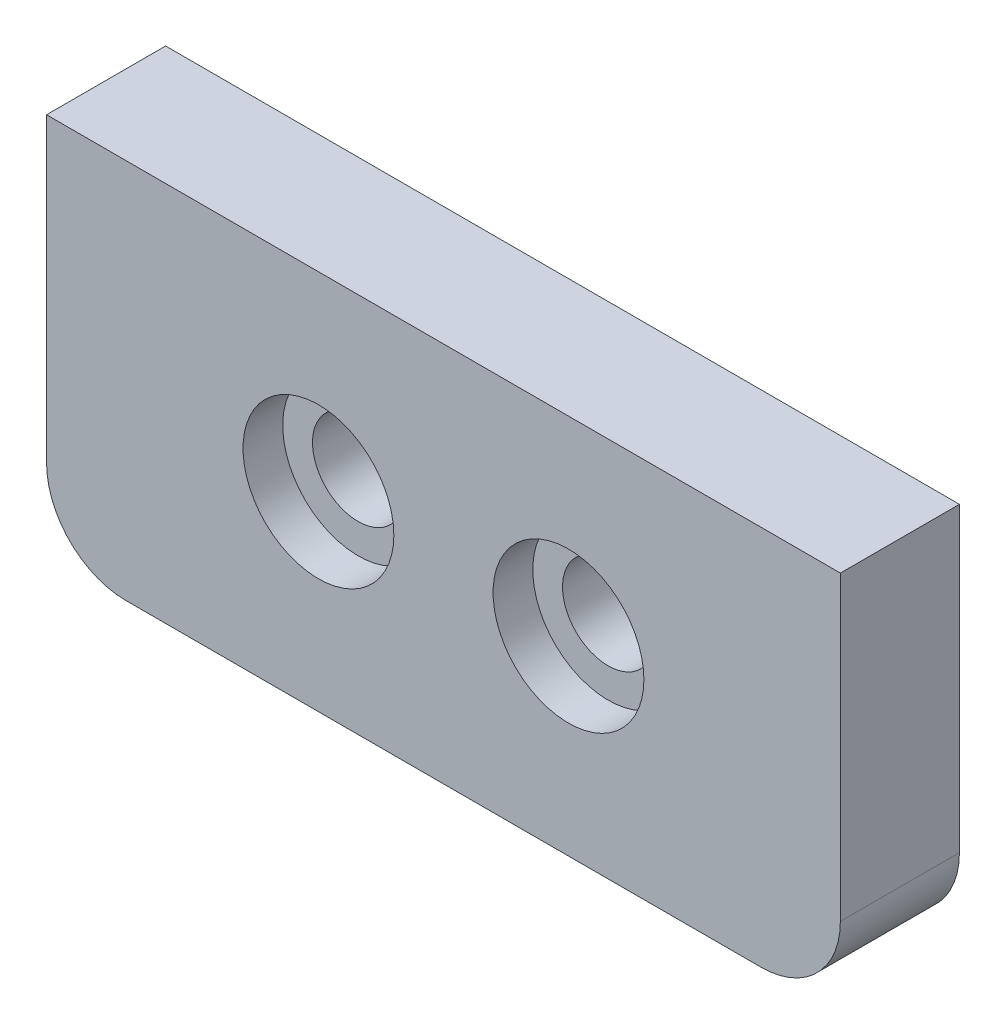
ISO-10303-21;
HEADER;
FILE_DESCRIPTION(('STEP AP214'),'2;1');
FILE_NAME('part.step','',(''),(''),'','','');
FILE_SCHEMA(('AUTOMOTIVE_DESIGN { 1 0 10303 214 1 1 1 1 }'));
ENDSEC;
DATA;
#1=APPLICATION_CONTEXT('core data for automotive mechanical design processes');
#2=APPLICATION_PROTOCOL_DEFINITION('international standard','automotive_design',2000,#1);
#3=PRODUCT_CONTEXT('',#1,'mechanical');
#4=PRODUCT('Part','Part','',(#3));
#5=PRODUCT_RELATED_PRODUCT_CATEGORY('part','',(#4));
#6=PRODUCT_DEFINITION_FORMATION('','',#4);
#7=PRODUCT_DEFINITION_CONTEXT('part definition',#1,'design');
#8=PRODUCT_DEFINITION('design','',#6,#7);
#9=PRODUCT_DEFINITION_SHAPE('','',#8);
#10=(LENGTH_UNIT() NAMED_UNIT(*) SI_UNIT(.MILLI.,.METRE.));
#11=(NAMED_UNIT(*) PLANE_ANGLE_UNIT() SI_UNIT($,.RADIAN.));
#12=(NAMED_UNIT(*) SI_UNIT($,.STERADIAN.) SOLID_ANGLE_UNIT());
#13=UNCERTAINTY_MEASURE_WITH_UNIT(LENGTH_MEASURE(1.E-05),#10,'distance_accuracy_value','');
#14=(GEOMETRIC_REPRESENTATION_CONTEXT(3) GLOBAL_UNCERTAINTY_ASSIGNED_CONTEXT((#13)) GLOBAL_UNIT_ASSIGNED_CONTEXT((#10,
#11,#12)) REPRESENTATION_CONTEXT('',''));
#15=CARTESIAN_POINT('',(0.,0.,0.));
#16=DIRECTION('',(0.,0.,1.));
#17=DIRECTION('',(1.,0.,0.));
#18=AXIS2_PLACEMENT_3D('',#15,#16,#17);
#19=CARTESIAN_POINT('',(6.85,4.8,3.));
#20=DIRECTION('',(0.,0.,-1.));
#21=DIRECTION('',(-1.,0.,0.));
#22=AXIS2_PLACEMENT_3D('',#19,#20,#21);
#23=CYLINDRICAL_SURFACE('',#22,1.15);
#24=CARTESIAN_POINT('',(6.85,4.8,0.));
#25=DIRECTION('',(0.,0.,1.));
#26=DIRECTION('',(1.,0.,0.));
#27=AXIS2_PLACEMENT_3D('',#24,#25,#26);
#28=CIRCLE('',#27,1.15);
#29=CARTESIAN_POINT('',(8.,4.8,0.));
#30=VERTEX_POINT('',#29);
#31=EDGE_CURVE('E116',#30,#30,#28,.T.);
#32=ORIENTED_EDGE('',*,*,#31,.F.);
#33=EDGE_LOOP('',(#32));
#34=FACE_BOUND('',#33,.T.);
#35=CARTESIAN_POINT('',(6.85,4.8,2.));
#36=DIRECTION('',(0.,0.,1.));
#37=DIRECTION('',(1.,0.,0.));
#38=AXIS2_PLACEMENT_3D('',#35,#36,#37);
#39=CIRCLE('',#38,1.15);
#40=CARTESIAN_POINT('',(8.,4.8,2.));
#41=VERTEX_POINT('',#40);
#42=EDGE_CURVE('E36',#41,#41,#39,.T.);
#43=ORIENTED_EDGE('',*,*,#42,.T.);
#44=EDGE_LOOP('',(#43));
#45=FACE_BOUND('',#44,.T.);
#46=ADVANCED_FACE('F32',(#34,#45),#23,.F.);
#47=CARTESIAN_POINT('',(13.15,4.8,3.));
#48=DIRECTION('',(0.,0.,-1.));
#49=DIRECTION('',(-1.,0.,0.));
#50=AXIS2_PLACEMENT_3D('',#47,#48,#49);
#51=CYLINDRICAL_SURFACE('',#50,1.15);
#52=CARTESIAN_POINT('',(13.15,4.8,0.));
#53=DIRECTION('',(0.,0.,1.));
#54=DIRECTION('',(1.,0.,0.));
#55=AXIS2_PLACEMENT_3D('',#52,#53,#54);
#56=CIRCLE('',#55,1.15);
#57=CARTESIAN_POINT('',(14.3,4.8,0.));
#58=VERTEX_POINT('',#57);
#59=EDGE_CURVE('E139',#58,#58,#56,.T.);
#60=ORIENTED_EDGE('',*,*,#59,.F.);
#61=EDGE_LOOP('',(#60));
#62=FACE_BOUND('',#61,.T.);
#63=CARTESIAN_POINT('',(13.15,4.8,2.));
#64=DIRECTION('',(0.,0.,1.));
#65=DIRECTION('',(1.,0.,0.));
#66=AXIS2_PLACEMENT_3D('',#63,#64,#65);
#67=CIRCLE('',#66,1.15);
#68=CARTESIAN_POINT('',(14.3,4.8,2.));
#69=VERTEX_POINT('',#68);
#70=EDGE_CURVE('E133',#69,#69,#67,.T.);
#71=ORIENTED_EDGE('',*,*,#70,.T.);
#72=EDGE_LOOP('',(#71));
#73=FACE_BOUND('',#72,.T.);
#74=ADVANCED_FACE('F182',(#62,#73),#51,.F.);
#75=CARTESIAN_POINT('',(0.,0.,3.));
#76=DIRECTION('',(0.,0.,-1.));
#77=DIRECTION('',(-1.,0.,0.));
#78=AXIS2_PLACEMENT_3D('',#75,#76,#77);
#79=PLANE('',#78);
#80=CARTESIAN_POINT('',(6.85,4.8,3.));
#81=DIRECTION('',(0.,0.,1.));
#82=DIRECTION('',(1.,0.,0.));
#83=AXIS2_PLACEMENT_3D('',#80,#81,#82);
#84=CIRCLE('',#83,1.9);
#85=CARTESIAN_POINT('',(8.75,4.8,3.));
#86=VERTEX_POINT('',#85);
#87=EDGE_CURVE('E141',#86,#86,#84,.T.);
#88=ORIENTED_EDGE('',*,*,#87,.F.);
#89=EDGE_LOOP('',(#88));
#90=FACE_BOUND('',#89,.T.);
#91=CARTESIAN_POINT('',(13.15,4.8,3.));
#92=DIRECTION('',(0.,0.,1.));
#93=DIRECTION('',(1.,0.,0.));
#94=AXIS2_PLACEMENT_3D('',#91,#92,#93);
#95=CIRCLE('',#94,1.9);
#96=CARTESIAN_POINT('',(15.05,4.8,3.));
#97=VERTEX_POINT('',#96);
#98=EDGE_CURVE('E151',#97,#97,#95,.T.);
#99=ORIENTED_EDGE('',*,*,#98,.F.);
#100=EDGE_LOOP('',(#99));
#101=FACE_BOUND('',#100,.T.);
#102=DIRECTION('',(0.,-1.,0.));
#103=VECTOR('',#102,1.);
#104=CARTESIAN_POINT('',(0.,0.,3.));
#105=LINE('',#104,#103);
#106=CARTESIAN_POINT('',(0.,9.6,3.));
#107=VERTEX_POINT('',#106);
#108=CARTESIAN_POINT('',(0.,2.,3.));
#109=VERTEX_POINT('',#108);
#110=EDGE_CURVE('E121',#107,#109,#105,.T.);
#111=ORIENTED_EDGE('',*,*,#110,.T.);
#112=CARTESIAN_POINT('',(2.,2.,3.));
#113=DIRECTION('',(0.,0.,-1.));
#114=DIRECTION('',(-1.,0.,0.));
#115=AXIS2_PLACEMENT_3D('',#112,#113,#114);
#116=CIRCLE('',#115,2.);
#117=CARTESIAN_POINT('',(2.,0.,3.));
#118=VERTEX_POINT('',#117);
#119=EDGE_CURVE('E41',#109,#118,#116,.F.);
#120=ORIENTED_EDGE('',*,*,#119,.T.);
#121=DIRECTION('',(1.,0.,0.));
#122=VECTOR('',#121,1.);
#123=CARTESIAN_POINT('',(0.,0.,3.));
#124=LINE('',#123,#122);
#125=CARTESIAN_POINT('',(18.,0.,3.));
#126=VERTEX_POINT('',#125);
#127=EDGE_CURVE('E95',#118,#126,#124,.T.);
#128=ORIENTED_EDGE('',*,*,#127,.T.);
#129=CARTESIAN_POINT('',(18.,2.,3.));
#130=DIRECTION('',(0.,0.,-1.));
#131=DIRECTION('',(-1.,0.,0.));
#132=AXIS2_PLACEMENT_3D('',#129,#130,#131);
#133=CIRCLE('',#132,2.);
#134=CARTESIAN_POINT('',(20.,2.,3.));
#135=VERTEX_POINT('',#134);
#136=EDGE_CURVE('E49',#126,#135,#133,.F.);
#137=ORIENTED_EDGE('',*,*,#136,.T.);
#138=DIRECTION('',(0.,1.,0.));
#139=VECTOR('',#138,1.);
#140=CARTESIAN_POINT('',(20.,0.,3.));
#141=LINE('',#140,#139);
#142=CARTESIAN_POINT('',(20.,9.6,3.));
#143=VERTEX_POINT('',#142);
#144=EDGE_CURVE('E87',#135,#143,#141,.T.);
#145=ORIENTED_EDGE('',*,*,#144,.T.);
#146=DIRECTION('',(-1.,0.,0.));
#147=VECTOR('',#146,1.);
#148=CARTESIAN_POINT('',(0.,9.6,3.));
#149=LINE('',#148,#147);
#150=EDGE_CURVE('E91',#143,#107,#149,.T.);
#151=ORIENTED_EDGE('',*,*,#150,.T.);
#152=EDGE_LOOP('',(#111,#120,#128,#137,#145,#151));
#153=FACE_BOUND('',#152,.T.);
#154=ADVANCED_FACE('F89',(#90,#101,#153),#79,.F.);
#155=CARTESIAN_POINT('',(0.,0.,0.));
#156=DIRECTION('',(0.,0.,-1.));
#157=DIRECTION('',(-1.,0.,0.));
#158=AXIS2_PLACEMENT_3D('',#155,#156,#157);
#159=PLANE('',#158);
#160=ORIENTED_EDGE('',*,*,#31,.T.);
#161=EDGE_LOOP('',(#160));
#162=FACE_BOUND('',#161,.T.);
#163=DIRECTION('',(1.,0.,0.));
#164=VECTOR('',#163,1.);
#165=CARTESIAN_POINT('',(0.,0.,0.));
#166=LINE('',#165,#164);
#167=CARTESIAN_POINT('',(2.,0.,0.));
#168=VERTEX_POINT('',#167);
#169=CARTESIAN_POINT('',(18.,0.,0.));
#170=VERTEX_POINT('',#169);
#171=EDGE_CURVE('E115',#168,#170,#166,.T.);
#172=ORIENTED_EDGE('',*,*,#171,.F.);
#173=CARTESIAN_POINT('',(2.,2.,0.));
#174=DIRECTION('',(0.,0.,-1.));
#175=DIRECTION('',(-1.,0.,0.));
#176=AXIS2_PLACEMENT_3D('',#173,#174,#175);
#177=CIRCLE('',#176,2.);
#178=CARTESIAN_POINT('',(0.,2.,0.));
#179=VERTEX_POINT('',#178);
#180=EDGE_CURVE('E129',#168,#179,#177,.T.);
#181=ORIENTED_EDGE('',*,*,#180,.T.);
#182=DIRECTION('',(0.,-1.,0.));
#183=VECTOR('',#182,1.);
#184=CARTESIAN_POINT('',(0.,0.,0.));
#185=LINE('',#184,#183);
#186=CARTESIAN_POINT('',(0.,9.6,0.));
#187=VERTEX_POINT('',#186);
#188=EDGE_CURVE('E113',#187,#179,#185,.T.);
#189=ORIENTED_EDGE('',*,*,#188,.F.);
#190=DIRECTION('',(-1.,0.,0.));
#191=VECTOR('',#190,1.);
#192=CARTESIAN_POINT('',(0.,9.6,0.));
#193=LINE('',#192,#191);
#194=CARTESIAN_POINT('',(20.,9.6,0.));
#195=VERTEX_POINT('',#194);
#196=EDGE_CURVE('E120',#195,#187,#193,.T.);
#197=ORIENTED_EDGE('',*,*,#196,.F.);
#198=DIRECTION('',(0.,1.,0.));
#199=VECTOR('',#198,1.);
#200=CARTESIAN_POINT('',(20.,0.,0.));
#201=LINE('',#200,#199);
#202=CARTESIAN_POINT('',(20.,2.,0.));
#203=VERTEX_POINT('',#202);
#204=EDGE_CURVE('E101',#203,#195,#201,.T.);
#205=ORIENTED_EDGE('',*,*,#204,.F.);
#206=CARTESIAN_POINT('',(18.,2.,0.));
#207=DIRECTION('',(0.,0.,-1.));
#208=DIRECTION('',(-1.,0.,0.));
#209=AXIS2_PLACEMENT_3D('',#206,#207,#208);
#210=CIRCLE('',#209,2.);
#211=EDGE_CURVE('E127',#203,#170,#210,.T.);
#212=ORIENTED_EDGE('',*,*,#211,.T.);
#213=EDGE_LOOP('',(#172,#181,#189,#197,#205,#212));
#214=FACE_BOUND('',#213,.T.);
#215=ORIENTED_EDGE('',*,*,#59,.T.);
#216=EDGE_LOOP('',(#215));
#217=FACE_BOUND('',#216,.T.);
#218=ADVANCED_FACE('F166',(#162,#214,#217),#159,.T.);
#219=CARTESIAN_POINT('',(0.,0.,3.));
#220=DIRECTION('',(1.,0.,0.));
#221=DIRECTION('',(0.,0.,-1.));
#222=AXIS2_PLACEMENT_3D('',#219,#220,#221);
#223=PLANE('',#222);
#224=ORIENTED_EDGE('',*,*,#188,.T.);
#225=DIRECTION('',(0.,0.,-1.));
#226=VECTOR('',#225,1.);
#227=CARTESIAN_POINT('',(0.,2.,3.));
#228=LINE('',#227,#226);
#229=EDGE_CURVE('E57',#179,#109,#228,.F.);
#230=ORIENTED_EDGE('',*,*,#229,.T.);
#231=ORIENTED_EDGE('',*,*,#110,.F.);
#232=DIRECTION('',(0.,0.,-1.));
#233=VECTOR('',#232,1.);
#234=CARTESIAN_POINT('',(0.,9.6,3.));
#235=LINE('',#234,#233);
#236=EDGE_CURVE('E105',#107,#187,#235,.T.);
#237=ORIENTED_EDGE('',*,*,#236,.T.);
#238=EDGE_LOOP('',(#224,#230,#231,#237));
#239=FACE_BOUND('',#238,.T.);
#240=ADVANCED_FACE('F169',(#239),#223,.F.);
#241=CARTESIAN_POINT('',(0.,0.,3.));
#242=DIRECTION('',(0.,1.,0.));
#243=DIRECTION('',(0.,0.,1.));
#244=AXIS2_PLACEMENT_3D('',#241,#242,#243);
#245=PLANE('',#244);
#246=ORIENTED_EDGE('',*,*,#127,.F.);
#247=DIRECTION('',(0.,0.,-1.));
#248=VECTOR('',#247,1.);
#249=CARTESIAN_POINT('',(2.,0.,3.));
#250=LINE('',#249,#248);
#251=EDGE_CURVE('E124',#118,#168,#250,.T.);
#252=ORIENTED_EDGE('',*,*,#251,.T.);
#253=ORIENTED_EDGE('',*,*,#171,.T.);
#254=DIRECTION('',(0.,0.,-1.));
#255=VECTOR('',#254,1.);
#256=CARTESIAN_POINT('',(18.,0.,3.));
#257=LINE('',#256,#255);
#258=EDGE_CURVE('E104',#170,#126,#257,.F.);
#259=ORIENTED_EDGE('',*,*,#258,.T.);
#260=EDGE_LOOP('',(#246,#252,#253,#259));
#261=FACE_BOUND('',#260,.T.);
#262=ADVANCED_FACE('F172',(#261),#245,.F.);
#263=CARTESIAN_POINT('',(20.,0.,3.));
#264=DIRECTION('',(-1.,0.,0.));
#265=DIRECTION('',(0.,0.,1.));
#266=AXIS2_PLACEMENT_3D('',#263,#264,#265);
#267=PLANE('',#266);
#268=ORIENTED_EDGE('',*,*,#144,.F.);
#269=DIRECTION('',(0.,0.,-1.));
#270=VECTOR('',#269,1.);
#271=CARTESIAN_POINT('',(20.,2.,3.));
#272=LINE('',#271,#270);
#273=EDGE_CURVE('E11',#135,#203,#272,.T.);
#274=ORIENTED_EDGE('',*,*,#273,.T.);
#275=ORIENTED_EDGE('',*,*,#204,.T.);
#276=DIRECTION('',(0.,0.,-1.));
#277=VECTOR('',#276,1.);
#278=CARTESIAN_POINT('',(20.,9.6,3.));
#279=LINE('',#278,#277);
#280=EDGE_CURVE('E98',#143,#195,#279,.T.);
#281=ORIENTED_EDGE('',*,*,#280,.F.);
#282=EDGE_LOOP('',(#268,#274,#275,#281));
#283=FACE_BOUND('',#282,.T.);
#284=ADVANCED_FACE('F99',(#283),#267,.F.);
#285=CARTESIAN_POINT('',(0.,9.6,3.));
#286=DIRECTION('',(0.,-1.,0.));
#287=DIRECTION('',(0.,0.,-1.));
#288=AXIS2_PLACEMENT_3D('',#285,#286,#287);
#289=PLANE('',#288);
#290=ORIENTED_EDGE('',*,*,#196,.T.);
#291=ORIENTED_EDGE('',*,*,#236,.F.);
#292=ORIENTED_EDGE('',*,*,#150,.F.);
#293=ORIENTED_EDGE('',*,*,#280,.T.);
#294=EDGE_LOOP('',(#290,#291,#292,#293));
#295=FACE_BOUND('',#294,.T.);
#296=ADVANCED_FACE('F107',(#295),#289,.F.);
#297=CARTESIAN_POINT('',(2.,2.,3.));
#298=DIRECTION('',(0.,0.,-1.));
#299=DIRECTION('',(-1.,0.,0.));
#300=AXIS2_PLACEMENT_3D('',#297,#298,#299);
#301=CYLINDRICAL_SURFACE('',#300,2.);
#302=ORIENTED_EDGE('',*,*,#119,.F.);
#303=ORIENTED_EDGE('',*,*,#229,.F.);
#304=ORIENTED_EDGE('',*,*,#180,.F.);
#305=ORIENTED_EDGE('',*,*,#251,.F.);
#306=EDGE_LOOP('',(#302,#303,#304,#305));
#307=FACE_BOUND('',#306,.T.);
#308=ADVANCED_FACE('F171',(#307),#301,.T.);
#309=CARTESIAN_POINT('',(18.,2.,3.));
#310=DIRECTION('',(0.,0.,-1.));
#311=DIRECTION('',(-1.,0.,0.));
#312=AXIS2_PLACEMENT_3D('',#309,#310,#311);
#313=CYLINDRICAL_SURFACE('',#312,2.);
#314=ORIENTED_EDGE('',*,*,#136,.F.);
#315=ORIENTED_EDGE('',*,*,#258,.F.);
#316=ORIENTED_EDGE('',*,*,#211,.F.);
#317=ORIENTED_EDGE('',*,*,#273,.F.);
#318=EDGE_LOOP('',(#314,#315,#316,#317));
#319=FACE_BOUND('',#318,.T.);
#320=ADVANCED_FACE('F34',(#319),#313,.T.);
#321=CARTESIAN_POINT('',(13.15,4.8,2.));
#322=DIRECTION('',(0.,0.,1.));
#323=DIRECTION('',(1.,0.,0.));
#324=AXIS2_PLACEMENT_3D('',#321,#322,#323);
#325=CYLINDRICAL_SURFACE('',#324,1.9);
#326=CARTESIAN_POINT('',(13.15,4.8,2.));
#327=DIRECTION('',(0.,0.,1.));
#328=DIRECTION('',(1.,0.,0.));
#329=AXIS2_PLACEMENT_3D('',#326,#327,#328);
#330=CIRCLE('',#329,1.9);
#331=CARTESIAN_POINT('',(15.05,4.8,2.));
#332=VERTEX_POINT('',#331);
#333=EDGE_CURVE('E146',#332,#332,#330,.T.);
#334=ORIENTED_EDGE('',*,*,#333,.F.);
#335=EDGE_LOOP('',(#334));
#336=FACE_BOUND('',#335,.T.);
#337=ORIENTED_EDGE('',*,*,#98,.T.);
#338=EDGE_LOOP('',(#337));
#339=FACE_BOUND('',#338,.T.);
#340=ADVANCED_FACE('F207',(#336,#339),#325,.F.);
#341=CARTESIAN_POINT('',(13.15,4.8,2.));
#342=DIRECTION('',(0.,0.,1.));
#343=DIRECTION('',(1.,0.,0.));
#344=AXIS2_PLACEMENT_3D('',#341,#342,#343);
#345=PLANE('',#344);
#346=ORIENTED_EDGE('',*,*,#70,.F.);
#347=EDGE_LOOP('',(#346));
#348=FACE_BOUND('',#347,.T.);
#349=ORIENTED_EDGE('',*,*,#333,.T.);
#350=EDGE_LOOP('',(#349));
#351=FACE_BOUND('',#350,.T.);
#352=ADVANCED_FACE('F211',(#348,#351),#345,.T.);
#353=CARTESIAN_POINT('',(6.85,4.8,2.));
#354=DIRECTION('',(0.,0.,1.));
#355=DIRECTION('',(1.,0.,0.));
#356=AXIS2_PLACEMENT_3D('',#353,#354,#355);
#357=CYLINDRICAL_SURFACE('',#356,1.9);
#358=CARTESIAN_POINT('',(6.85,4.8,2.));
#359=DIRECTION('',(0.,0.,1.));
#360=DIRECTION('',(1.,0.,0.));
#361=AXIS2_PLACEMENT_3D('',#358,#359,#360);
#362=CIRCLE('',#361,1.9);
#363=CARTESIAN_POINT('',(8.75,4.8,2.));
#364=VERTEX_POINT('',#363);
#365=EDGE_CURVE('E135',#364,#364,#362,.T.);
#366=ORIENTED_EDGE('',*,*,#365,.F.);
#367=EDGE_LOOP('',(#366));
#368=FACE_BOUND('',#367,.T.);
#369=ORIENTED_EDGE('',*,*,#87,.T.);
#370=EDGE_LOOP('',(#369));
#371=FACE_BOUND('',#370,.T.);
#372=ADVANCED_FACE('F216',(#368,#371),#357,.F.);
#373=CARTESIAN_POINT('',(6.85,4.8,2.));
#374=DIRECTION('',(0.,0.,1.));
#375=DIRECTION('',(1.,0.,0.));
#376=AXIS2_PLACEMENT_3D('',#373,#374,#375);
#377=PLANE('',#376);
#378=ORIENTED_EDGE('',*,*,#42,.F.);
#379=EDGE_LOOP('',(#378));
#380=FACE_BOUND('',#379,.T.);
#381=ORIENTED_EDGE('',*,*,#365,.T.);
#382=EDGE_LOOP('',(#381));
#383=FACE_BOUND('',#382,.T.);
#384=ADVANCED_FACE('F224',(#380,#383),#377,.T.);
#385=CLOSED_SHELL('',(#46,#74,#154,#218,#240,#262,#284,#296,#308,#320,#340,#352,#372,#384));
#386=MANIFOLD_SOLID_BREP('B2',#385);
#387=ADVANCED_BREP_SHAPE_REPRESENTATION('',(#18,#386),#14);
#388=SHAPE_DEFINITION_REPRESENTATION(#9,#387);
ENDSEC;
END-ISO-10303-21;
